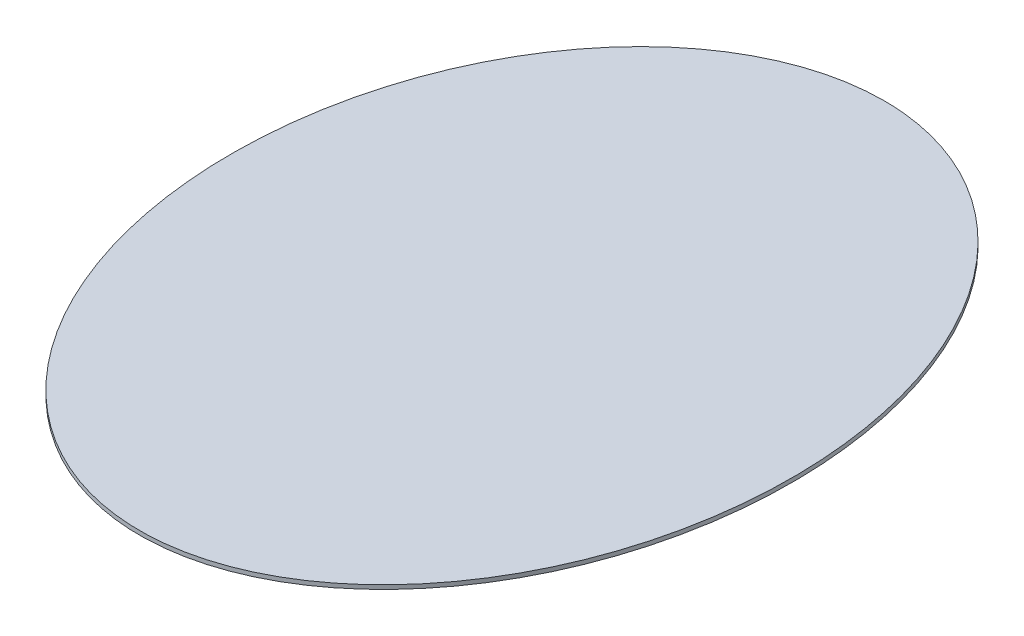
ISO-10303-21;
HEADER;
FILE_DESCRIPTION(('STEP AP214'),'2;1');
FILE_NAME('part.step','',(''),(''),'','','');
FILE_SCHEMA(('AUTOMOTIVE_DESIGN { 1 0 10303 214 1 1 1 1 }'));
ENDSEC;
DATA;
#1=APPLICATION_CONTEXT('core data for automotive mechanical design processes');
#2=APPLICATION_PROTOCOL_DEFINITION('international standard','automotive_design',2000,#1);
#3=PRODUCT_CONTEXT('',#1,'mechanical');
#4=PRODUCT('Part','Part','',(#3));
#5=PRODUCT_RELATED_PRODUCT_CATEGORY('part','',(#4));
#6=PRODUCT_DEFINITION_FORMATION('','',#4);
#7=PRODUCT_DEFINITION_CONTEXT('part definition',#1,'design');
#8=PRODUCT_DEFINITION('design','',#6,#7);
#9=PRODUCT_DEFINITION_SHAPE('','',#8);
#10=(LENGTH_UNIT() NAMED_UNIT(*) SI_UNIT(.MILLI.,.METRE.));
#11=(NAMED_UNIT(*) PLANE_ANGLE_UNIT() SI_UNIT($,.RADIAN.));
#12=(NAMED_UNIT(*) SI_UNIT($,.STERADIAN.) SOLID_ANGLE_UNIT());
#13=UNCERTAINTY_MEASURE_WITH_UNIT(LENGTH_MEASURE(1.E-05),#10,'distance_accuracy_value','');
#14=(GEOMETRIC_REPRESENTATION_CONTEXT(3) GLOBAL_UNCERTAINTY_ASSIGNED_CONTEXT((#13)) GLOBAL_UNIT_ASSIGNED_CONTEXT((#10,
#11,#12)) REPRESENTATION_CONTEXT('',''));
#15=CARTESIAN_POINT('',(0.,0.,0.));
#16=DIRECTION('',(0.,0.,1.));
#17=DIRECTION('',(1.,0.,0.));
#18=AXIS2_PLACEMENT_3D('',#15,#16,#17);
#19=CARTESIAN_POINT('',(0.,4.,0.));
#20=DIRECTION('',(0.,1.,0.));
#21=DIRECTION('',(0.,0.,-1.));
#22=AXIS2_PLACEMENT_3D('',#19,#20,#21);
#23=ELLIPSE('',#22,365.,275.);
#24=DIRECTION('',(0.,-1.,0.));
#25=VECTOR('',#24,1.);
#26=SURFACE_OF_LINEAR_EXTRUSION('',#23,#25);
#27=CARTESIAN_POINT('',(0.,4.,-365.));
#28=VERTEX_POINT('',#27);
#29=EDGE_CURVE('E10',#28,#28,#23,.T.);
#30=ORIENTED_EDGE('',*,*,#29,.F.);
#31=EDGE_LOOP('',(#30));
#32=FACE_BOUND('',#31,.T.);
#33=CARTESIAN_POINT('',(0.,0.,0.));
#34=DIRECTION('',(0.,1.,0.));
#35=DIRECTION('',(0.,0.,-1.));
#36=AXIS2_PLACEMENT_3D('',#33,#34,#35);
#37=ELLIPSE('',#36,365.,275.);
#38=CARTESIAN_POINT('',(0.,0.,-365.));
#39=VERTEX_POINT('',#38);
#40=EDGE_CURVE('E34',#39,#39,#37,.T.);
#41=ORIENTED_EDGE('',*,*,#40,.T.);
#42=EDGE_LOOP('',(#41));
#43=FACE_BOUND('',#42,.T.);
#44=ADVANCED_FACE('F30',(#32,#43),#26,.F.);
#45=CARTESIAN_POINT('',(0.,4.,0.));
#46=DIRECTION('',(0.,1.,0.));
#47=DIRECTION('',(0.,0.,1.));
#48=AXIS2_PLACEMENT_3D('',#45,#46,#47);
#49=PLANE('',#48);
#50=ORIENTED_EDGE('',*,*,#29,.T.);
#51=EDGE_LOOP('',(#50));
#52=FACE_BOUND('',#51,.T.);
#53=ADVANCED_FACE('F46',(#52),#49,.T.);
#54=CARTESIAN_POINT('',(0.,0.,0.));
#55=DIRECTION('',(0.,1.,0.));
#56=DIRECTION('',(0.,0.,1.));
#57=AXIS2_PLACEMENT_3D('',#54,#55,#56);
#58=PLANE('',#57);
#59=ORIENTED_EDGE('',*,*,#40,.F.);
#60=EDGE_LOOP('',(#59));
#61=FACE_BOUND('',#60,.T.);
#62=ADVANCED_FACE('F44',(#61),#58,.F.);
#63=CLOSED_SHELL('',(#44,#53,#62));
#64=MANIFOLD_SOLID_BREP('B2',#63);
#65=ADVANCED_BREP_SHAPE_REPRESENTATION('',(#18,#64),#14);
#66=SHAPE_DEFINITION_REPRESENTATION(#9,#65);
ENDSEC;
END-ISO-10303-21;
